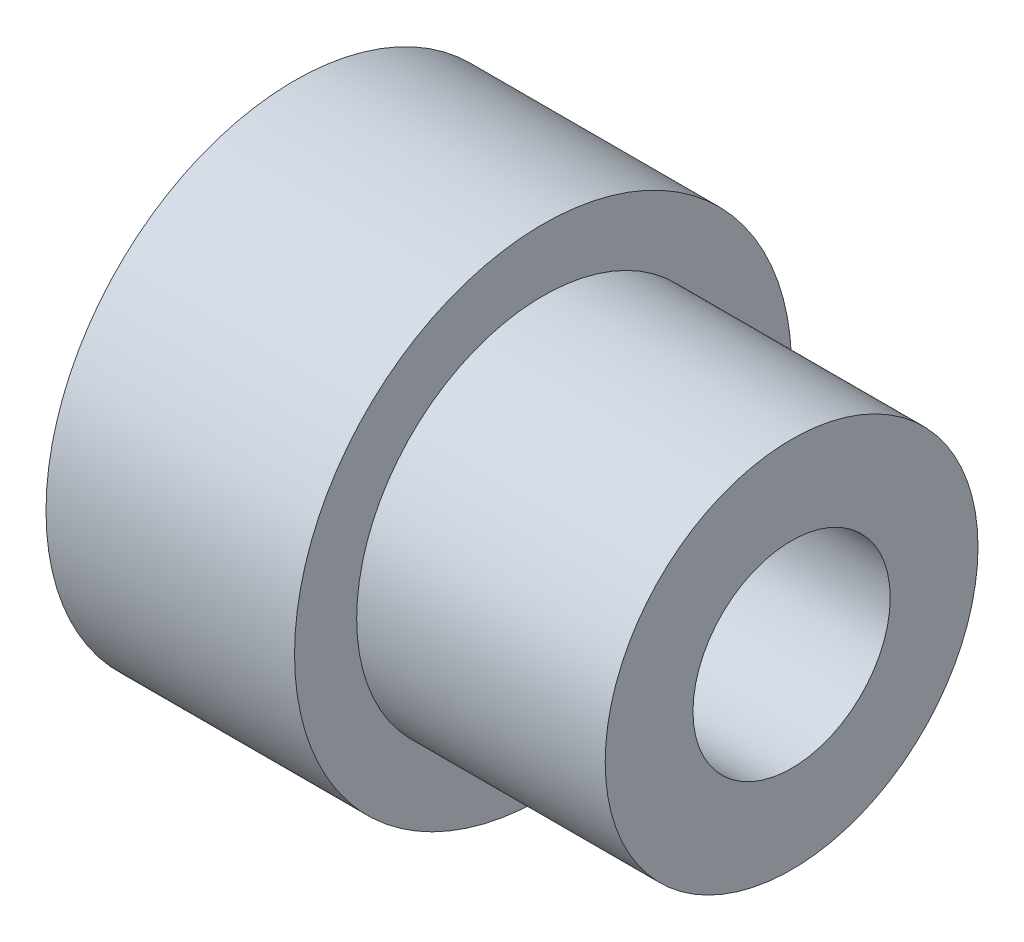
ISO-10303-21;
HEADER;
FILE_DESCRIPTION(('STEP AP214'),'2;1');
FILE_NAME('part.step','',(''),(''),'','','');
FILE_SCHEMA(('AUTOMOTIVE_DESIGN { 1 0 10303 214 1 1 1 1 }'));
ENDSEC;
DATA;
#1=APPLICATION_CONTEXT('core data for automotive mechanical design processes');
#2=APPLICATION_PROTOCOL_DEFINITION('international standard','automotive_design',2000,#1);
#3=PRODUCT_CONTEXT('',#1,'mechanical');
#4=PRODUCT('Part','Part','',(#3));
#5=PRODUCT_RELATED_PRODUCT_CATEGORY('part','',(#4));
#6=PRODUCT_DEFINITION_FORMATION('','',#4);
#7=PRODUCT_DEFINITION_CONTEXT('part definition',#1,'design');
#8=PRODUCT_DEFINITION('design','',#6,#7);
#9=PRODUCT_DEFINITION_SHAPE('','',#8);
#10=(LENGTH_UNIT() NAMED_UNIT(*) SI_UNIT(.MILLI.,.METRE.));
#11=(NAMED_UNIT(*) PLANE_ANGLE_UNIT() SI_UNIT($,.RADIAN.));
#12=(NAMED_UNIT(*) SI_UNIT($,.STERADIAN.) SOLID_ANGLE_UNIT());
#13=UNCERTAINTY_MEASURE_WITH_UNIT(LENGTH_MEASURE(1.E-05),#10,'distance_accuracy_value','');
#14=(GEOMETRIC_REPRESENTATION_CONTEXT(3) GLOBAL_UNCERTAINTY_ASSIGNED_CONTEXT((#13)) GLOBAL_UNIT_ASSIGNED_CONTEXT((#10,
#11,#12)) REPRESENTATION_CONTEXT('',''));
#15=CARTESIAN_POINT('',(0.,0.,0.));
#16=DIRECTION('',(0.,0.,1.));
#17=DIRECTION('',(1.,0.,0.));
#18=AXIS2_PLACEMENT_3D('',#15,#16,#17);
#19=CARTESIAN_POINT('',(8.000000002,0.,0.));
#20=DIRECTION('',(-1.,0.,0.));
#21=DIRECTION('',(0.,0.,1.));
#22=AXIS2_PLACEMENT_3D('',#19,#20,#21);
#23=CYLINDRICAL_SURFACE('',#22,5.999999938);
#24=CARTESIAN_POINT('',(8.000000002,0.,0.));
#25=DIRECTION('',(1.,0.,0.));
#26=DIRECTION('',(0.,0.,-1.));
#27=AXIS2_PLACEMENT_3D('',#24,#25,#26);
#28=CIRCLE('',#27,5.999999938);
#29=CARTESIAN_POINT('',(8.000000002,0.,-5.999999938));
#30=VERTEX_POINT('',#29);
#31=EDGE_CURVE('E10',#30,#30,#28,.T.);
#32=ORIENTED_EDGE('',*,*,#31,.F.);
#33=EDGE_LOOP('',(#32));
#34=FACE_BOUND('',#33,.T.);
#35=CARTESIAN_POINT('',(0.,0.,0.));
#36=DIRECTION('',(1.,0.,0.));
#37=DIRECTION('',(0.,0.,-1.));
#38=AXIS2_PLACEMENT_3D('',#35,#36,#37);
#39=CIRCLE('',#38,5.999999938);
#40=CARTESIAN_POINT('',(0.,0.,-5.999999938));
#41=VERTEX_POINT('',#40);
#42=EDGE_CURVE('E34',#41,#41,#39,.T.);
#43=ORIENTED_EDGE('',*,*,#42,.T.);
#44=EDGE_LOOP('',(#43));
#45=FACE_BOUND('',#44,.T.);
#46=ADVANCED_FACE('F31',(#34,#45),#23,.T.);
#47=CARTESIAN_POINT('',(8.000000002,0.,0.));
#48=DIRECTION('',(1.,0.,0.));
#49=DIRECTION('',(0.,0.,-1.));
#50=AXIS2_PLACEMENT_3D('',#47,#48,#49);
#51=PLANE('',#50);
#52=CARTESIAN_POINT('',(8.000000002,0.,0.));
#53=DIRECTION('',(1.,0.,0.));
#54=DIRECTION('',(0.,0.,-1.));
#55=AXIS2_PLACEMENT_3D('',#52,#53,#54);
#56=CIRCLE('',#55,3.175);
#57=CARTESIAN_POINT('',(8.000000002,0.,-3.175));
#58=VERTEX_POINT('',#57);
#59=EDGE_CURVE('E49',#58,#58,#56,.T.);
#60=ORIENTED_EDGE('',*,*,#59,.F.);
#61=EDGE_LOOP('',(#60));
#62=FACE_BOUND('',#61,.T.);
#63=ORIENTED_EDGE('',*,*,#31,.T.);
#64=EDGE_LOOP('',(#63));
#65=FACE_BOUND('',#64,.T.);
#66=ADVANCED_FACE('F65',(#62,#65),#51,.T.);
#67=CARTESIAN_POINT('',(-8.000000002,0.,0.));
#68=DIRECTION('',(1.,0.,0.));
#69=DIRECTION('',(0.,0.,-1.));
#70=AXIS2_PLACEMENT_3D('',#67,#68,#69);
#71=CYLINDRICAL_SURFACE('',#70,8.000000002);
#72=CARTESIAN_POINT('',(-8.000000002,0.,0.));
#73=DIRECTION('',(-1.,0.,0.));
#74=DIRECTION('',(0.,0.,1.));
#75=AXIS2_PLACEMENT_3D('',#72,#73,#74);
#76=CIRCLE('',#75,8.000000002);
#77=CARTESIAN_POINT('',(-8.000000002,0.,8.000000002));
#78=VERTEX_POINT('',#77);
#79=EDGE_CURVE('E41',#78,#78,#76,.T.);
#80=ORIENTED_EDGE('',*,*,#79,.F.);
#81=EDGE_LOOP('',(#80));
#82=FACE_BOUND('',#81,.T.);
#83=CARTESIAN_POINT('',(0.,0.,0.));
#84=DIRECTION('',(-1.,0.,0.));
#85=DIRECTION('',(0.,0.,1.));
#86=AXIS2_PLACEMENT_3D('',#83,#84,#85);
#87=CIRCLE('',#86,8.000000002);
#88=CARTESIAN_POINT('',(0.,0.,8.000000002));
#89=VERTEX_POINT('',#88);
#90=EDGE_CURVE('E43',#89,#89,#87,.T.);
#91=ORIENTED_EDGE('',*,*,#90,.T.);
#92=EDGE_LOOP('',(#91));
#93=FACE_BOUND('',#92,.T.);
#94=ADVANCED_FACE('F67',(#82,#93),#71,.T.);
#95=CARTESIAN_POINT('',(-8.000000002,0.,0.));
#96=DIRECTION('',(-1.,0.,0.));
#97=DIRECTION('',(0.,0.,1.));
#98=AXIS2_PLACEMENT_3D('',#95,#96,#97);
#99=PLANE('',#98);
#100=CARTESIAN_POINT('',(-8.000000002,0.,0.));
#101=DIRECTION('',(1.,0.,0.));
#102=DIRECTION('',(0.,0.,-1.));
#103=AXIS2_PLACEMENT_3D('',#100,#101,#102);
#104=CIRCLE('',#103,3.175);
#105=CARTESIAN_POINT('',(-8.000000002,0.,-3.175));
#106=VERTEX_POINT('',#105);
#107=EDGE_CURVE('E46',#106,#106,#104,.T.);
#108=ORIENTED_EDGE('',*,*,#107,.T.);
#109=EDGE_LOOP('',(#108));
#110=FACE_BOUND('',#109,.T.);
#111=ORIENTED_EDGE('',*,*,#79,.T.);
#112=EDGE_LOOP('',(#111));
#113=FACE_BOUND('',#112,.T.);
#114=ADVANCED_FACE('F55',(#110,#113),#99,.T.);
#115=CARTESIAN_POINT('',(0.,0.,0.));
#116=DIRECTION('',(-1.,0.,0.));
#117=DIRECTION('',(0.,0.,1.));
#118=AXIS2_PLACEMENT_3D('',#115,#116,#117);
#119=PLANE('',#118);
#120=ORIENTED_EDGE('',*,*,#42,.F.);
#121=EDGE_LOOP('',(#120));
#122=FACE_BOUND('',#121,.T.);
#123=ORIENTED_EDGE('',*,*,#90,.F.);
#124=EDGE_LOOP('',(#123));
#125=FACE_BOUND('',#124,.T.);
#126=ADVANCED_FACE('F61',(#122,#125),#119,.F.);
#127=CARTESIAN_POINT('',(-8.000000002,0.,0.));
#128=DIRECTION('',(1.,0.,0.));
#129=DIRECTION('',(0.,0.,-1.));
#130=AXIS2_PLACEMENT_3D('',#127,#128,#129);
#131=CYLINDRICAL_SURFACE('',#130,3.175);
#132=ORIENTED_EDGE('',*,*,#107,.F.);
#133=EDGE_LOOP('',(#132));
#134=FACE_BOUND('',#133,.T.);
#135=ORIENTED_EDGE('',*,*,#59,.T.);
#136=EDGE_LOOP('',(#135));
#137=FACE_BOUND('',#136,.T.);
#138=ADVANCED_FACE('F58',(#134,#137),#131,.F.);
#139=CLOSED_SHELL('',(#46,#66,#94,#114,#126,#138));
#140=MANIFOLD_SOLID_BREP('B2',#139);
#141=ADVANCED_BREP_SHAPE_REPRESENTATION('',(#18,#140),#14);
#142=SHAPE_DEFINITION_REPRESENTATION(#9,#141);
ENDSEC;
END-ISO-10303-21;
